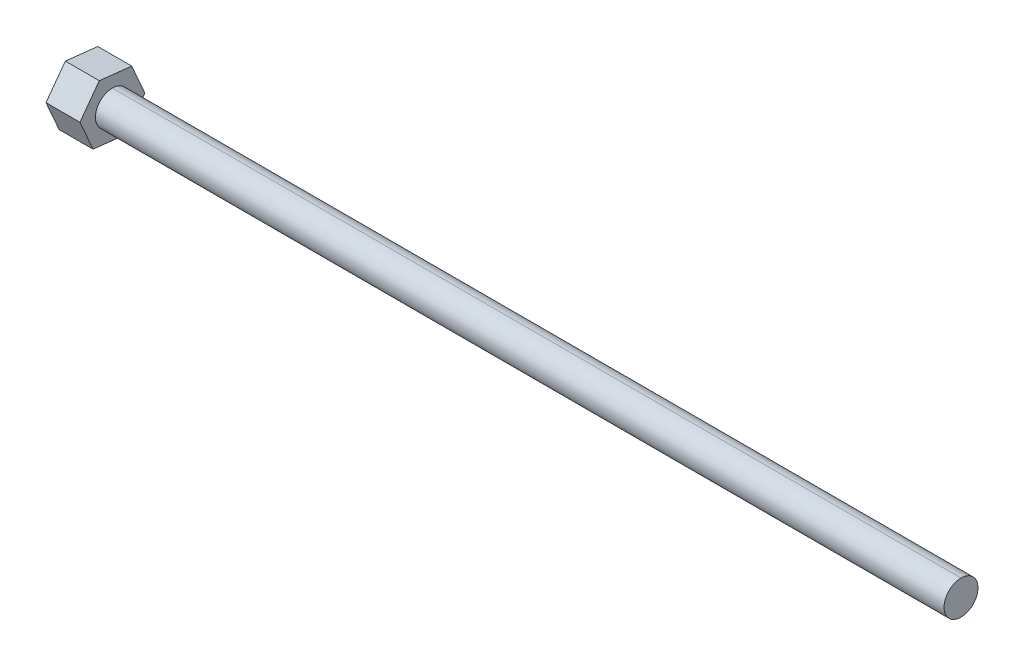
ISO-10303-21;
HEADER;
FILE_DESCRIPTION(('STEP AP214'),'2;1');
FILE_NAME('part.step','',(''),(''),'','','');
FILE_SCHEMA(('AUTOMOTIVE_DESIGN { 1 0 10303 214 1 1 1 1 }'));
ENDSEC;
DATA;
#1=APPLICATION_CONTEXT('core data for automotive mechanical design processes');
#2=APPLICATION_PROTOCOL_DEFINITION('international standard','automotive_design',2000,#1);
#3=PRODUCT_CONTEXT('',#1,'mechanical');
#4=PRODUCT('Part','Part','',(#3));
#5=PRODUCT_RELATED_PRODUCT_CATEGORY('part','',(#4));
#6=PRODUCT_DEFINITION_FORMATION('','',#4);
#7=PRODUCT_DEFINITION_CONTEXT('part definition',#1,'design');
#8=PRODUCT_DEFINITION('design','',#6,#7);
#9=PRODUCT_DEFINITION_SHAPE('','',#8);
#10=(LENGTH_UNIT() NAMED_UNIT(*) SI_UNIT(.MILLI.,.METRE.));
#11=(NAMED_UNIT(*) PLANE_ANGLE_UNIT() SI_UNIT($,.RADIAN.));
#12=(NAMED_UNIT(*) SI_UNIT($,.STERADIAN.) SOLID_ANGLE_UNIT());
#13=UNCERTAINTY_MEASURE_WITH_UNIT(LENGTH_MEASURE(1.E-05),#10,'distance_accuracy_value','');
#14=(GEOMETRIC_REPRESENTATION_CONTEXT(3) GLOBAL_UNCERTAINTY_ASSIGNED_CONTEXT((#13)) GLOBAL_UNIT_ASSIGNED_CONTEXT((#10,
#11,#12)) REPRESENTATION_CONTEXT('',''));
#15=CARTESIAN_POINT('',(0.,0.,0.));
#16=DIRECTION('',(0.,0.,1.));
#17=DIRECTION('',(1.,0.,0.));
#18=AXIS2_PLACEMENT_3D('',#15,#16,#17);
#19=CARTESIAN_POINT('',(95.3324243825069,0.,0.));
#20=DIRECTION('',(-1.,0.,0.));
#21=DIRECTION('',(0.,1.,0.));
#22=AXIS2_PLACEMENT_3D('',#19,#20,#21);
#23=CYLINDRICAL_SURFACE('',#22,1.15384615369962);
#24=DIRECTION('',(1.,0.,0.));
#25=VECTOR('',#24,1.);
#26=CARTESIAN_POINT('',(95.3324243825069,1.15384615369961,0.));
#27=LINE('',#26,#25);
#28=CARTESIAN_POINT('',(66.4862705400166,1.15384615369961,0.));
#29=VERTEX_POINT('',#28);
#30=CARTESIAN_POINT('',(124.178578224997,1.15384615369961,0.));
#31=VERTEX_POINT('',#30);
#32=EDGE_CURVE('E71',#29,#31,#27,.T.);
#33=ORIENTED_EDGE('',*,*,#32,.F.);
#34=CARTESIAN_POINT('',(66.4862705400166,0.,0.));
#35=DIRECTION('',(1.,0.,0.));
#36=DIRECTION('',(0.,1.,0.));
#37=AXIS2_PLACEMENT_3D('',#34,#35,#36);
#38=CIRCLE('',#37,1.15384615369962);
#39=CARTESIAN_POINT('',(66.4862705400166,-1.15384615369962,0.));
#40=VERTEX_POINT('',#39);
#41=EDGE_CURVE('E11',#29,#40,#38,.T.);
#42=ORIENTED_EDGE('',*,*,#41,.T.);
#43=DIRECTION('',(1.,0.,0.));
#44=VECTOR('',#43,1.);
#45=CARTESIAN_POINT('',(95.3324243825069,-1.15384615369962,0.));
#46=LINE('',#45,#44);
#47=CARTESIAN_POINT('',(124.178578224997,-1.15384615369962,0.));
#48=VERTEX_POINT('',#47);
#49=EDGE_CURVE('E58',#40,#48,#46,.T.);
#50=ORIENTED_EDGE('',*,*,#49,.T.);
#51=CARTESIAN_POINT('',(124.178578224997,0.,0.));
#52=DIRECTION('',(1.,0.,0.));
#53=DIRECTION('',(0.,1.,0.));
#54=AXIS2_PLACEMENT_3D('',#51,#52,#53);
#55=CIRCLE('',#54,1.15384615369962);
#56=EDGE_CURVE('E140',#31,#48,#55,.T.);
#57=ORIENTED_EDGE('',*,*,#56,.F.);
#58=EDGE_LOOP('',(#33,#42,#50,#57));
#59=FACE_BOUND('',#58,.T.);
#60=ADVANCED_FACE('F48',(#59),#23,.T.);
#61=CARTESIAN_POINT('',(95.3324243825069,0.,0.));
#62=DIRECTION('',(-1.,0.,0.));
#63=DIRECTION('',(0.,1.,0.));
#64=AXIS2_PLACEMENT_3D('',#61,#62,#63);
#65=CYLINDRICAL_SURFACE('',#64,1.15384615369962);
#66=ORIENTED_EDGE('',*,*,#49,.F.);
#67=CARTESIAN_POINT('',(66.4862705400166,0.,0.));
#68=DIRECTION('',(1.,0.,0.));
#69=DIRECTION('',(0.,1.,0.));
#70=AXIS2_PLACEMENT_3D('',#67,#68,#69);
#71=CIRCLE('',#70,1.15384615369962);
#72=EDGE_CURVE('E153',#40,#29,#71,.T.);
#73=ORIENTED_EDGE('',*,*,#72,.T.);
#74=ORIENTED_EDGE('',*,*,#32,.T.);
#75=CARTESIAN_POINT('',(124.178578224997,0.,0.));
#76=DIRECTION('',(1.,0.,0.));
#77=DIRECTION('',(0.,1.,0.));
#78=AXIS2_PLACEMENT_3D('',#75,#76,#77);
#79=CIRCLE('',#78,1.15384615369962);
#80=EDGE_CURVE('E145',#48,#31,#79,.T.);
#81=ORIENTED_EDGE('',*,*,#80,.F.);
#82=EDGE_LOOP('',(#66,#73,#74,#81));
#83=FACE_BOUND('',#82,.T.);
#84=ADVANCED_FACE('F156',(#83),#65,.T.);
#85=CARTESIAN_POINT('',(124.178578224997,0.,0.));
#86=DIRECTION('',(1.,0.,0.));
#87=DIRECTION('',(0.,1.,0.));
#88=AXIS2_PLACEMENT_3D('',#85,#86,#87);
#89=PLANE('',#88);
#90=ORIENTED_EDGE('',*,*,#56,.T.);
#91=ORIENTED_EDGE('',*,*,#80,.T.);
#92=EDGE_LOOP('',(#90,#91));
#93=FACE_BOUND('',#92,.T.);
#94=ADVANCED_FACE('F143',(#93),#89,.T.);
#95=CARTESIAN_POINT('',(66.4862705400166,0.,0.));
#96=DIRECTION('',(1.,0.,0.));
#97=DIRECTION('',(0.,1.,0.));
#98=AXIS2_PLACEMENT_3D('',#95,#96,#97);
#99=PLANE('',#98);
#100=DIRECTION('',(0.,-0.805931758941364,0.592008445826307));
#101=VECTOR('',#100,1.);
#102=CARTESIAN_POINT('',(66.4862705400166,1.1384777802906,1.54986876699812));
#103=LINE('',#102,#101);
#104=CARTESIAN_POINT('',(66.4862705400166,2.03329493012555,0.892568314080913));
#105=VERTEX_POINT('',#104);
#106=CARTESIAN_POINT('',(66.4862705400166,0.24366063045565,2.20716921991532));
#107=VERTEX_POINT('',#106);
#108=EDGE_CURVE('E51',#105,#107,#103,.T.);
#109=ORIENTED_EDGE('',*,*,#108,.T.);
#110=DIRECTION('',(0.,-0.9156602328112,-0.401953154046761));
#111=VECTOR('',#110,1.);
#112=CARTESIAN_POINT('',(66.4862705400166,-0.77298683460712,1.76088506287485));
#113=LINE('',#112,#111);
#114=CARTESIAN_POINT('',(66.4862705400166,-1.7896342996699,1.31460090583438));
#115=VERTEX_POINT('',#114);
#116=EDGE_CURVE('E162',#107,#115,#113,.T.);
#117=ORIENTED_EDGE('',*,*,#116,.T.);
#118=DIRECTION('',(0.,-0.109728473869842,-0.993961599873051));
#119=VECTOR('',#118,1.);
#120=CARTESIAN_POINT('',(66.4862705400166,-1.91146461489773,0.211016295876751));
#121=LINE('',#120,#119);
#122=CARTESIAN_POINT('',(66.4862705400166,-2.03329493012557,-0.892568314080879));
#123=VERTEX_POINT('',#122);
#124=EDGE_CURVE('E195',#115,#123,#121,.T.);
#125=ORIENTED_EDGE('',*,*,#124,.T.);
#126=DIRECTION('',(0.,0.805931758941364,-0.592008445826307));
#127=VECTOR('',#126,1.);
#128=CARTESIAN_POINT('',(66.4862705400166,-1.13847778029062,-1.54986876699808));
#129=LINE('',#128,#127);
#130=CARTESIAN_POINT('',(66.4862705400166,-0.243660630455695,-2.20716921991526));
#131=VERTEX_POINT('',#130);
#132=EDGE_CURVE('E218',#123,#131,#129,.T.);
#133=ORIENTED_EDGE('',*,*,#132,.T.);
#134=DIRECTION('',(0.,0.915660232811213,0.401953154046731));
#135=VECTOR('',#134,1.);
#136=CARTESIAN_POINT('',(66.4862705400166,0.772986834607084,-1.76088506287484));
#137=LINE('',#136,#135);
#138=CARTESIAN_POINT('',(66.4862705400166,1.78963429966986,-1.31460090583441));
#139=VERTEX_POINT('',#138);
#140=EDGE_CURVE('E222',#131,#139,#137,.T.);
#141=ORIENTED_EDGE('',*,*,#140,.T.);
#142=DIRECTION('',(0.,0.109728473869842,0.993961599873051));
#143=VECTOR('',#142,1.);
#144=CARTESIAN_POINT('',(66.4862705400166,1.91146461489771,-0.211016295876755));
#145=LINE('',#144,#143);
#146=EDGE_CURVE('E111',#139,#105,#145,.T.);
#147=ORIENTED_EDGE('',*,*,#146,.T.);
#148=EDGE_LOOP('',(#109,#117,#125,#133,#141,#147));
#149=FACE_BOUND('',#148,.T.);
#150=ORIENTED_EDGE('',*,*,#41,.F.);
#151=ORIENTED_EDGE('',*,*,#72,.F.);
#152=EDGE_LOOP('',(#150,#151));
#153=FACE_BOUND('',#152,.T.);
#154=ADVANCED_FACE('F257',(#149,#153),#99,.T.);
#155=CARTESIAN_POINT('',(64.1785782326174,0.,0.));
#156=DIRECTION('',(1.,0.,0.));
#157=DIRECTION('',(0.,1.,0.));
#158=AXIS2_PLACEMENT_3D('',#155,#156,#157);
#159=PLANE('',#158);
#160=DIRECTION('',(0.,0.109728473869842,0.993961599873051));
#161=VECTOR('',#160,1.);
#162=CARTESIAN_POINT('',(64.1785782326174,1.91146461489771,-0.211016295876755));
#163=LINE('',#162,#161);
#164=CARTESIAN_POINT('',(64.1785782326174,1.78963429966986,-1.31460090583441));
#165=VERTEX_POINT('',#164);
#166=CARTESIAN_POINT('',(64.1785782326174,2.03329493012555,0.892568314080913));
#167=VERTEX_POINT('',#166);
#168=EDGE_CURVE('E174',#165,#167,#163,.T.);
#169=ORIENTED_EDGE('',*,*,#168,.F.);
#170=DIRECTION('',(0.,0.915660232811213,0.401953154046731));
#171=VECTOR('',#170,1.);
#172=CARTESIAN_POINT('',(64.1785782326174,0.772986834607084,-1.76088506287484));
#173=LINE('',#172,#171);
#174=CARTESIAN_POINT('',(64.1785782326174,-0.243660630455695,-2.20716921991526));
#175=VERTEX_POINT('',#174);
#176=EDGE_CURVE('E175',#175,#165,#173,.T.);
#177=ORIENTED_EDGE('',*,*,#176,.F.);
#178=DIRECTION('',(0.,0.805931758941364,-0.592008445826307));
#179=VECTOR('',#178,1.);
#180=CARTESIAN_POINT('',(64.1785782326174,-1.13847778029062,-1.54986876699808));
#181=LINE('',#180,#179);
#182=CARTESIAN_POINT('',(64.1785782326174,-2.03329493012557,-0.892568314080879));
#183=VERTEX_POINT('',#182);
#184=EDGE_CURVE('E187',#183,#175,#181,.T.);
#185=ORIENTED_EDGE('',*,*,#184,.F.);
#186=DIRECTION('',(0.,-0.109728473869842,-0.993961599873051));
#187=VECTOR('',#186,1.);
#188=CARTESIAN_POINT('',(64.1785782326174,-1.91146461489773,0.211016295876751));
#189=LINE('',#188,#187);
#190=CARTESIAN_POINT('',(64.1785782326174,-1.7896342996699,1.31460090583438));
#191=VERTEX_POINT('',#190);
#192=EDGE_CURVE('E203',#191,#183,#189,.T.);
#193=ORIENTED_EDGE('',*,*,#192,.F.);
#194=DIRECTION('',(0.,-0.9156602328112,-0.401953154046761));
#195=VECTOR('',#194,1.);
#196=CARTESIAN_POINT('',(64.1785782326174,-0.77298683460712,1.76088506287485));
#197=LINE('',#196,#195);
#198=CARTESIAN_POINT('',(64.1785782326174,0.24366063045565,2.20716921991532));
#199=VERTEX_POINT('',#198);
#200=EDGE_CURVE('E166',#199,#191,#197,.T.);
#201=ORIENTED_EDGE('',*,*,#200,.F.);
#202=DIRECTION('',(0.,-0.805931758941364,0.592008445826307));
#203=VECTOR('',#202,1.);
#204=CARTESIAN_POINT('',(64.1785782326174,1.1384777802906,1.54986876699812));
#205=LINE('',#204,#203);
#206=EDGE_CURVE('E165',#167,#199,#205,.T.);
#207=ORIENTED_EDGE('',*,*,#206,.F.);
#208=EDGE_LOOP('',(#169,#177,#185,#193,#201,#207));
#209=FACE_BOUND('',#208,.T.);
#210=ADVANCED_FACE('F251',(#209),#159,.F.);
#211=CARTESIAN_POINT('',(64.1785782326174,1.78963429966988,-1.31460090583441));
#212=DIRECTION('',(0.,0.993961599873051,-0.109728473869842));
#213=DIRECTION('',(0.,0.109728473869842,0.993961599873051));
#214=AXIS2_PLACEMENT_3D('',#211,#212,#213);
#215=PLANE('',#214);
#216=DIRECTION('',(1.,0.,0.));
#217=VECTOR('',#216,1.);
#218=CARTESIAN_POINT('',(65.332424386317,1.78963429966986,-1.3146009058344));
#219=LINE('',#218,#217);
#220=EDGE_CURVE('E178',#165,#139,#219,.T.);
#221=ORIENTED_EDGE('',*,*,#220,.F.);
#222=ORIENTED_EDGE('',*,*,#168,.T.);
#223=DIRECTION('',(1.,0.,0.));
#224=VECTOR('',#223,1.);
#225=CARTESIAN_POINT('',(65.332424386317,2.03329493012555,0.892568314080913));
#226=LINE('',#225,#224);
#227=EDGE_CURVE('E171',#167,#105,#226,.T.);
#228=ORIENTED_EDGE('',*,*,#227,.T.);
#229=ORIENTED_EDGE('',*,*,#146,.F.);
#230=EDGE_LOOP('',(#221,#222,#228,#229));
#231=FACE_BOUND('',#230,.T.);
#232=ADVANCED_FACE('F260',(#231),#215,.T.);
#233=CARTESIAN_POINT('',(64.1785782326174,-0.243660630455692,-2.20716921991526));
#234=DIRECTION('',(0.,0.401953154046731,-0.915660232811213));
#235=DIRECTION('',(0.,0.915660232811213,0.401953154046731));
#236=AXIS2_PLACEMENT_3D('',#233,#234,#235);
#237=PLANE('',#236);
#238=DIRECTION('',(1.,0.,0.));
#239=VECTOR('',#238,1.);
#240=CARTESIAN_POINT('',(65.332424386317,-0.243660630455695,-2.20716921991526));
#241=LINE('',#240,#239);
#242=EDGE_CURVE('E192',#175,#131,#241,.T.);
#243=ORIENTED_EDGE('',*,*,#242,.F.);
#244=ORIENTED_EDGE('',*,*,#176,.T.);
#245=ORIENTED_EDGE('',*,*,#220,.T.);
#246=ORIENTED_EDGE('',*,*,#140,.F.);
#247=EDGE_LOOP('',(#243,#244,#245,#246));
#248=FACE_BOUND('',#247,.T.);
#249=ADVANCED_FACE('F263',(#248),#237,.T.);
#250=CARTESIAN_POINT('',(64.1785782326174,-2.03329493012555,-0.89256831408089));
#251=DIRECTION('',(0.,-0.592008445826307,-0.805931758941364));
#252=DIRECTION('',(0.,0.805931758941364,-0.592008445826307));
#253=AXIS2_PLACEMENT_3D('',#250,#251,#252);
#254=PLANE('',#253);
#255=DIRECTION('',(1.,0.,0.));
#256=VECTOR('',#255,1.);
#257=CARTESIAN_POINT('',(65.332424386317,-2.03329493012557,-0.892568314080881));
#258=LINE('',#257,#256);
#259=EDGE_CURVE('E169',#183,#123,#258,.T.);
#260=ORIENTED_EDGE('',*,*,#259,.F.);
#261=ORIENTED_EDGE('',*,*,#184,.T.);
#262=ORIENTED_EDGE('',*,*,#242,.T.);
#263=ORIENTED_EDGE('',*,*,#132,.F.);
#264=EDGE_LOOP('',(#260,#261,#262,#263));
#265=FACE_BOUND('',#264,.T.);
#266=ADVANCED_FACE('F266',(#265),#254,.T.);
#267=CARTESIAN_POINT('',(64.1785782326174,-1.7896342996699,1.31460090583438));
#268=DIRECTION('',(0.,-0.993961599873051,0.109728473869842));
#269=DIRECTION('',(0.,-0.109728473869842,-0.993961599873051));
#270=AXIS2_PLACEMENT_3D('',#267,#268,#269);
#271=PLANE('',#270);
#272=DIRECTION('',(1.,0.,0.));
#273=VECTOR('',#272,1.);
#274=CARTESIAN_POINT('',(65.332424386317,-1.7896342996699,1.31460090583438));
#275=LINE('',#274,#273);
#276=EDGE_CURVE('E170',#191,#115,#275,.T.);
#277=ORIENTED_EDGE('',*,*,#276,.F.);
#278=ORIENTED_EDGE('',*,*,#192,.T.);
#279=ORIENTED_EDGE('',*,*,#259,.T.);
#280=ORIENTED_EDGE('',*,*,#124,.F.);
#281=EDGE_LOOP('',(#277,#278,#279,#280));
#282=FACE_BOUND('',#281,.T.);
#283=ADVANCED_FACE('F269',(#282),#271,.T.);
#284=CARTESIAN_POINT('',(64.1785782326174,0.24366063045566,2.20716921991533));
#285=DIRECTION('',(0.,-0.401953154046761,0.9156602328112));
#286=DIRECTION('',(0.,-0.9156602328112,-0.401953154046761));
#287=AXIS2_PLACEMENT_3D('',#284,#285,#286);
#288=PLANE('',#287);
#289=DIRECTION('',(1.,0.,0.));
#290=VECTOR('',#289,1.);
#291=CARTESIAN_POINT('',(65.332424386317,0.243660630455649,2.20716921991532));
#292=LINE('',#291,#290);
#293=EDGE_CURVE('E212',#199,#107,#292,.T.);
#294=ORIENTED_EDGE('',*,*,#293,.F.);
#295=ORIENTED_EDGE('',*,*,#200,.T.);
#296=ORIENTED_EDGE('',*,*,#276,.T.);
#297=ORIENTED_EDGE('',*,*,#116,.F.);
#298=EDGE_LOOP('',(#294,#295,#296,#297));
#299=FACE_BOUND('',#298,.T.);
#300=ADVANCED_FACE('F254',(#299),#288,.T.);
#301=CARTESIAN_POINT('',(64.1785782326174,2.03329493012555,0.892568314080913));
#302=DIRECTION('',(0.,0.592008445826307,0.805931758941364));
#303=DIRECTION('',(0.,-0.805931758941364,0.592008445826307));
#304=AXIS2_PLACEMENT_3D('',#301,#302,#303);
#305=PLANE('',#304);
#306=ORIENTED_EDGE('',*,*,#227,.F.);
#307=ORIENTED_EDGE('',*,*,#206,.T.);
#308=ORIENTED_EDGE('',*,*,#293,.T.);
#309=ORIENTED_EDGE('',*,*,#108,.F.);
#310=EDGE_LOOP('',(#306,#307,#308,#309));
#311=FACE_BOUND('',#310,.T.);
#312=ADVANCED_FACE('F245',(#311),#305,.T.);
#313=CLOSED_SHELL('',(#60,#84,#94,#154,#210,#232,#249,#266,#283,#300,#312));
#314=MANIFOLD_SOLID_BREP('B2',#313);
#315=ADVANCED_BREP_SHAPE_REPRESENTATION('',(#18,#314),#14);
#316=SHAPE_DEFINITION_REPRESENTATION(#9,#315);
ENDSEC;
END-ISO-10303-21;
